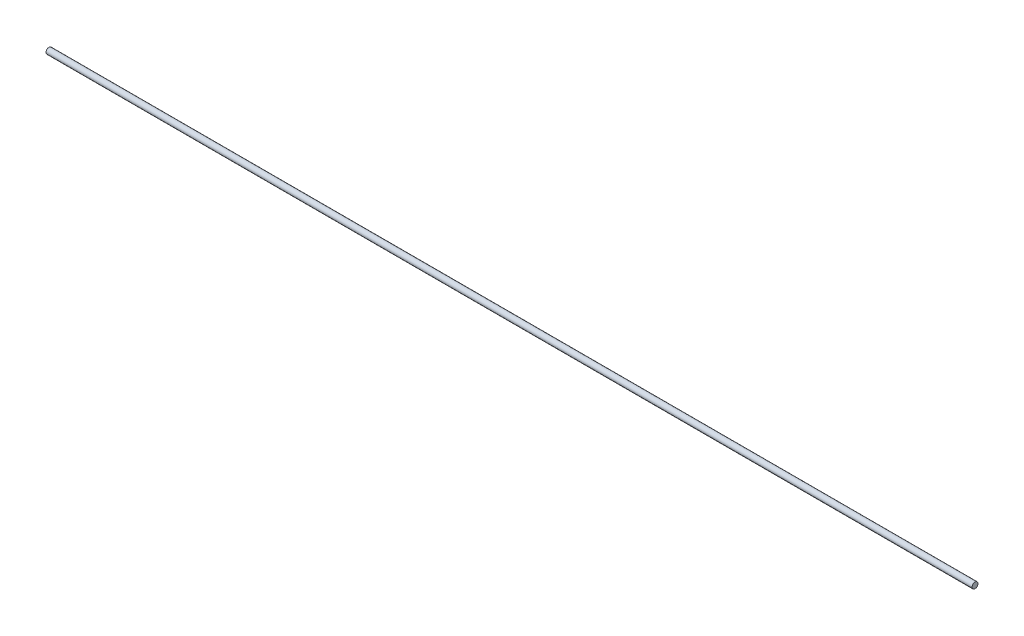
ISO-10303-21;
HEADER;
FILE_DESCRIPTION(('STEP AP214'),'2;1');
FILE_NAME('part.step','',(''),(''),'','','');
FILE_SCHEMA(('AUTOMOTIVE_DESIGN { 1 0 10303 214 1 1 1 1 }'));
ENDSEC;
DATA;
#1=APPLICATION_CONTEXT('core data for automotive mechanical design processes');
#2=APPLICATION_PROTOCOL_DEFINITION('international standard','automotive_design',2000,#1);
#3=PRODUCT_CONTEXT('',#1,'mechanical');
#4=PRODUCT('Part','Part','',(#3));
#5=PRODUCT_RELATED_PRODUCT_CATEGORY('part','',(#4));
#6=PRODUCT_DEFINITION_FORMATION('','',#4);
#7=PRODUCT_DEFINITION_CONTEXT('part definition',#1,'design');
#8=PRODUCT_DEFINITION('design','',#6,#7);
#9=PRODUCT_DEFINITION_SHAPE('','',#8);
#10=(LENGTH_UNIT() NAMED_UNIT(*) SI_UNIT(.MILLI.,.METRE.));
#11=(NAMED_UNIT(*) PLANE_ANGLE_UNIT() SI_UNIT($,.RADIAN.));
#12=(NAMED_UNIT(*) SI_UNIT($,.STERADIAN.) SOLID_ANGLE_UNIT());
#13=UNCERTAINTY_MEASURE_WITH_UNIT(LENGTH_MEASURE(1.E-05),#10,'distance_accuracy_value','');
#14=(GEOMETRIC_REPRESENTATION_CONTEXT(3) GLOBAL_UNCERTAINTY_ASSIGNED_CONTEXT((#13)) GLOBAL_UNIT_ASSIGNED_CONTEXT((#10,
#11,#12)) REPRESENTATION_CONTEXT('',''));
#15=CARTESIAN_POINT('',(0.,0.,0.));
#16=DIRECTION('',(0.,0.,1.));
#17=DIRECTION('',(1.,0.,0.));
#18=AXIS2_PLACEMENT_3D('',#15,#16,#17);
#19=CARTESIAN_POINT('',(469.,0.,0.));
#20=DIRECTION('',(1.,0.,0.));
#21=DIRECTION('',(0.,0.,-1.));
#22=AXIS2_PLACEMENT_3D('',#19,#20,#21);
#23=PLANE('',#22);
#24=CARTESIAN_POINT('',(469.,0.,0.));
#25=DIRECTION('',(1.,0.,0.));
#26=DIRECTION('',(0.,0.,-1.));
#27=AXIS2_PLACEMENT_3D('',#24,#25,#26);
#28=CIRCLE('',#27,3.);
#29=CARTESIAN_POINT('',(469.,0.,-3.));
#30=VERTEX_POINT('',#29);
#31=EDGE_CURVE('E10',#30,#30,#28,.T.);
#32=ORIENTED_EDGE('',*,*,#31,.T.);
#33=EDGE_LOOP('',(#32));
#34=FACE_BOUND('',#33,.T.);
#35=CARTESIAN_POINT('',(469.,0.,0.));
#36=DIRECTION('',(1.,0.,0.));
#37=DIRECTION('',(0.,0.,-1.));
#38=AXIS2_PLACEMENT_3D('',#35,#36,#37);
#39=CIRCLE('',#38,0.00299999999999996);
#40=CARTESIAN_POINT('',(469.,0.,-0.00299999999999996));
#41=VERTEX_POINT('',#40);
#42=EDGE_CURVE('E42',#41,#41,#39,.T.);
#43=ORIENTED_EDGE('',*,*,#42,.F.);
#44=EDGE_LOOP('',(#43));
#45=FACE_BOUND('',#44,.T.);
#46=ADVANCED_FACE('F31',(#34,#45),#23,.T.);
#47=CARTESIAN_POINT('',(-469.,0.,0.));
#48=DIRECTION('',(1.,0.,0.));
#49=DIRECTION('',(0.,0.,-1.));
#50=AXIS2_PLACEMENT_3D('',#47,#48,#49);
#51=PLANE('',#50);
#52=CARTESIAN_POINT('',(-469.,0.,0.));
#53=DIRECTION('',(1.,0.,0.));
#54=DIRECTION('',(0.,0.,-1.));
#55=AXIS2_PLACEMENT_3D('',#52,#53,#54);
#56=CIRCLE('',#55,3.);
#57=CARTESIAN_POINT('',(-469.,0.,-3.));
#58=VERTEX_POINT('',#57);
#59=EDGE_CURVE('E35',#58,#58,#56,.T.);
#60=ORIENTED_EDGE('',*,*,#59,.F.);
#61=EDGE_LOOP('',(#60));
#62=FACE_BOUND('',#61,.T.);
#63=CARTESIAN_POINT('',(-469.,0.,0.));
#64=DIRECTION('',(1.,0.,0.));
#65=DIRECTION('',(0.,0.,-1.));
#66=AXIS2_PLACEMENT_3D('',#63,#64,#65);
#67=CIRCLE('',#66,0.00299999999999996);
#68=CARTESIAN_POINT('',(-469.,0.,-0.00299999999999996));
#69=VERTEX_POINT('',#68);
#70=EDGE_CURVE('E44',#69,#69,#67,.T.);
#71=ORIENTED_EDGE('',*,*,#70,.T.);
#72=EDGE_LOOP('',(#71));
#73=FACE_BOUND('',#72,.T.);
#74=ADVANCED_FACE('F54',(#62,#73),#51,.F.);
#75=CARTESIAN_POINT('',(469.,0.,0.));
#76=DIRECTION('',(-1.,0.,0.));
#77=DIRECTION('',(0.,0.,1.));
#78=AXIS2_PLACEMENT_3D('',#75,#76,#77);
#79=CYLINDRICAL_SURFACE('',#78,3.);
#80=ORIENTED_EDGE('',*,*,#31,.F.);
#81=EDGE_LOOP('',(#80));
#82=FACE_BOUND('',#81,.T.);
#83=ORIENTED_EDGE('',*,*,#59,.T.);
#84=EDGE_LOOP('',(#83));
#85=FACE_BOUND('',#84,.T.);
#86=ADVANCED_FACE('F33',(#82,#85),#79,.T.);
#87=CARTESIAN_POINT('',(469.,0.,0.));
#88=DIRECTION('',(-1.,0.,0.));
#89=DIRECTION('',(0.,0.,1.));
#90=AXIS2_PLACEMENT_3D('',#87,#88,#89);
#91=CYLINDRICAL_SURFACE('',#90,0.00299999999999996);
#92=ORIENTED_EDGE('',*,*,#42,.T.);
#93=EDGE_LOOP('',(#92));
#94=FACE_BOUND('',#93,.T.);
#95=ORIENTED_EDGE('',*,*,#70,.F.);
#96=EDGE_LOOP('',(#95));
#97=FACE_BOUND('',#96,.T.);
#98=ADVANCED_FACE('F50',(#94,#97),#91,.F.);
#99=CLOSED_SHELL('',(#46,#74,#86,#98));
#100=MANIFOLD_SOLID_BREP('B2',#99);
#101=ADVANCED_BREP_SHAPE_REPRESENTATION('',(#18,#100),#14);
#102=SHAPE_DEFINITION_REPRESENTATION(#9,#101);
ENDSEC;
END-ISO-10303-21;
